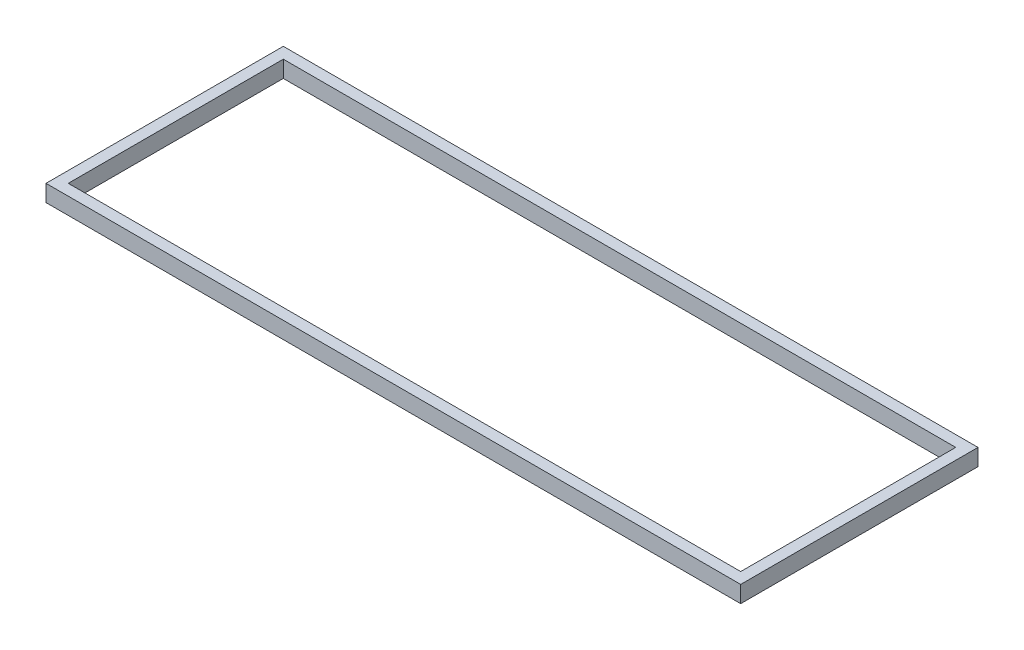
ISO-10303-21;
HEADER;
FILE_DESCRIPTION(('STEP AP214'),'2;1');
FILE_NAME('part.step','',(''),(''),'','','');
FILE_SCHEMA(('AUTOMOTIVE_DESIGN { 1 0 10303 214 1 1 1 1 }'));
ENDSEC;
DATA;
#1=APPLICATION_CONTEXT('core data for automotive mechanical design processes');
#2=APPLICATION_PROTOCOL_DEFINITION('international standard','automotive_design',2000,#1);
#3=PRODUCT_CONTEXT('',#1,'mechanical');
#4=PRODUCT('Part','Part','',(#3));
#5=PRODUCT_RELATED_PRODUCT_CATEGORY('part','',(#4));
#6=PRODUCT_DEFINITION_FORMATION('','',#4);
#7=PRODUCT_DEFINITION_CONTEXT('part definition',#1,'design');
#8=PRODUCT_DEFINITION('design','',#6,#7);
#9=PRODUCT_DEFINITION_SHAPE('','',#8);
#10=(LENGTH_UNIT() NAMED_UNIT(*) SI_UNIT(.MILLI.,.METRE.));
#11=(NAMED_UNIT(*) PLANE_ANGLE_UNIT() SI_UNIT($,.RADIAN.));
#12=(NAMED_UNIT(*) SI_UNIT($,.STERADIAN.) SOLID_ANGLE_UNIT());
#13=UNCERTAINTY_MEASURE_WITH_UNIT(LENGTH_MEASURE(1.E-05),#10,'distance_accuracy_value','');
#14=(GEOMETRIC_REPRESENTATION_CONTEXT(3) GLOBAL_UNCERTAINTY_ASSIGNED_CONTEXT((#13)) GLOBAL_UNIT_ASSIGNED_CONTEXT((#10,
#11,#12)) REPRESENTATION_CONTEXT('',''));
#15=CARTESIAN_POINT('',(0.,0.,0.));
#16=DIRECTION('',(0.,0.,1.));
#17=DIRECTION('',(1.,0.,0.));
#18=AXIS2_PLACEMENT_3D('',#15,#16,#17);
#19=CARTESIAN_POINT('',(0.,6.,0.));
#20=DIRECTION('',(0.,-1.,0.));
#21=DIRECTION('',(0.,0.,-1.));
#22=AXIS2_PLACEMENT_3D('',#19,#20,#21);
#23=PLANE('',#22);
#24=DIRECTION('',(0.,0.,1.));
#25=VECTOR('',#24,1.);
#26=CARTESIAN_POINT('',(0.,6.,0.));
#27=LINE('',#26,#25);
#28=CARTESIAN_POINT('',(0.,6.,-85.25));
#29=VERTEX_POINT('',#28);
#30=CARTESIAN_POINT('',(0.,6.,0.));
#31=VERTEX_POINT('',#30);
#32=EDGE_CURVE('E153',#29,#31,#27,.T.);
#33=ORIENTED_EDGE('',*,*,#32,.T.);
#34=DIRECTION('',(1.,0.,0.));
#35=VECTOR('',#34,1.);
#36=CARTESIAN_POINT('',(0.,6.,0.));
#37=LINE('',#36,#35);
#38=CARTESIAN_POINT('',(249.56,6.,0.));
#39=VERTEX_POINT('',#38);
#40=EDGE_CURVE('E157',#31,#39,#37,.T.);
#41=ORIENTED_EDGE('',*,*,#40,.T.);
#42=DIRECTION('',(0.,0.,-1.));
#43=VECTOR('',#42,1.);
#44=CARTESIAN_POINT('',(249.56,6.,0.));
#45=LINE('',#44,#43);
#46=CARTESIAN_POINT('',(249.56,6.,-85.25));
#47=VERTEX_POINT('',#46);
#48=EDGE_CURVE('E161',#39,#47,#45,.T.);
#49=ORIENTED_EDGE('',*,*,#48,.T.);
#50=DIRECTION('',(-1.,0.,0.));
#51=VECTOR('',#50,1.);
#52=CARTESIAN_POINT('',(0.,6.,-85.25));
#53=LINE('',#52,#51);
#54=EDGE_CURVE('E164',#47,#29,#53,.T.);
#55=ORIENTED_EDGE('',*,*,#54,.T.);
#56=EDGE_LOOP('',(#33,#41,#49,#55));
#57=FACE_BOUND('',#56,.T.);
#58=DIRECTION('',(0.,0.,1.));
#59=VECTOR('',#58,1.);
#60=CARTESIAN_POINT('',(4.,6.,-81.25));
#61=LINE('',#60,#59);
#62=CARTESIAN_POINT('',(4.,6.,-81.25));
#63=VERTEX_POINT('',#62);
#64=CARTESIAN_POINT('',(4.00000000000001,6.,-4.));
#65=VERTEX_POINT('',#64);
#66=EDGE_CURVE('E105',#63,#65,#61,.T.);
#67=ORIENTED_EDGE('',*,*,#66,.F.);
#68=DIRECTION('',(-1.,0.,0.));
#69=VECTOR('',#68,1.);
#70=CARTESIAN_POINT('',(4.,6.,-81.25));
#71=LINE('',#70,#69);
#72=CARTESIAN_POINT('',(245.56,6.,-81.25));
#73=VERTEX_POINT('',#72);
#74=EDGE_CURVE('E131',#73,#63,#71,.T.);
#75=ORIENTED_EDGE('',*,*,#74,.F.);
#76=DIRECTION('',(0.,0.,-1.));
#77=VECTOR('',#76,1.);
#78=CARTESIAN_POINT('',(245.56,6.,-81.25));
#79=LINE('',#78,#77);
#80=CARTESIAN_POINT('',(245.56,6.,-4.));
#81=VERTEX_POINT('',#80);
#82=EDGE_CURVE('E127',#81,#73,#79,.T.);
#83=ORIENTED_EDGE('',*,*,#82,.F.);
#84=DIRECTION('',(1.,0.,0.));
#85=VECTOR('',#84,1.);
#86=CARTESIAN_POINT('',(4.00000000000001,6.,-4.));
#87=LINE('',#86,#85);
#88=EDGE_CURVE('E114',#65,#81,#87,.T.);
#89=ORIENTED_EDGE('',*,*,#88,.F.);
#90=EDGE_LOOP('',(#67,#75,#83,#89));
#91=FACE_BOUND('',#90,.T.);
#92=ADVANCED_FACE('F39',(#57,#91),#23,.F.);
#93=CARTESIAN_POINT('',(0.,0.,0.));
#94=DIRECTION('',(0.,-1.,0.));
#95=DIRECTION('',(0.,0.,-1.));
#96=AXIS2_PLACEMENT_3D('',#93,#94,#95);
#97=PLANE('',#96);
#98=DIRECTION('',(0.,0.,1.));
#99=VECTOR('',#98,1.);
#100=CARTESIAN_POINT('',(0.,0.,0.));
#101=LINE('',#100,#99);
#102=CARTESIAN_POINT('',(0.,0.,-85.25));
#103=VERTEX_POINT('',#102);
#104=CARTESIAN_POINT('',(0.,0.,0.));
#105=VERTEX_POINT('',#104);
#106=EDGE_CURVE('E123',#103,#105,#101,.T.);
#107=ORIENTED_EDGE('',*,*,#106,.F.);
#108=DIRECTION('',(-1.,0.,0.));
#109=VECTOR('',#108,1.);
#110=CARTESIAN_POINT('',(0.,0.,-85.25));
#111=LINE('',#110,#109);
#112=CARTESIAN_POINT('',(249.56,0.,-85.25));
#113=VERTEX_POINT('',#112);
#114=EDGE_CURVE('E158',#113,#103,#111,.T.);
#115=ORIENTED_EDGE('',*,*,#114,.F.);
#116=DIRECTION('',(0.,0.,-1.));
#117=VECTOR('',#116,1.);
#118=CARTESIAN_POINT('',(249.56,0.,0.));
#119=LINE('',#118,#117);
#120=CARTESIAN_POINT('',(249.56,0.,0.));
#121=VERTEX_POINT('',#120);
#122=EDGE_CURVE('E174',#121,#113,#119,.T.);
#123=ORIENTED_EDGE('',*,*,#122,.F.);
#124=DIRECTION('',(1.,0.,0.));
#125=VECTOR('',#124,1.);
#126=CARTESIAN_POINT('',(0.,0.,0.));
#127=LINE('',#126,#125);
#128=EDGE_CURVE('E171',#105,#121,#127,.T.);
#129=ORIENTED_EDGE('',*,*,#128,.F.);
#130=EDGE_LOOP('',(#107,#115,#123,#129));
#131=FACE_BOUND('',#130,.T.);
#132=DIRECTION('',(-1.,0.,0.));
#133=VECTOR('',#132,1.);
#134=CARTESIAN_POINT('',(4.,0.,-81.25));
#135=LINE('',#134,#133);
#136=CARTESIAN_POINT('',(245.56,0.,-81.25));
#137=VERTEX_POINT('',#136);
#138=CARTESIAN_POINT('',(4.,0.,-81.25));
#139=VERTEX_POINT('',#138);
#140=EDGE_CURVE('E115',#137,#139,#135,.T.);
#141=ORIENTED_EDGE('',*,*,#140,.T.);
#142=DIRECTION('',(0.,0.,1.));
#143=VECTOR('',#142,1.);
#144=CARTESIAN_POINT('',(4.,0.,-81.25));
#145=LINE('',#144,#143);
#146=CARTESIAN_POINT('',(4.00000000000001,0.,-4.));
#147=VERTEX_POINT('',#146);
#148=EDGE_CURVE('E63',#139,#147,#145,.T.);
#149=ORIENTED_EDGE('',*,*,#148,.T.);
#150=DIRECTION('',(1.,0.,0.));
#151=VECTOR('',#150,1.);
#152=CARTESIAN_POINT('',(4.00000000000001,0.,-4.));
#153=LINE('',#152,#151);
#154=CARTESIAN_POINT('',(245.56,0.,-4.));
#155=VERTEX_POINT('',#154);
#156=EDGE_CURVE('E121',#147,#155,#153,.T.);
#157=ORIENTED_EDGE('',*,*,#156,.T.);
#158=DIRECTION('',(0.,0.,-1.));
#159=VECTOR('',#158,1.);
#160=CARTESIAN_POINT('',(245.56,0.,-81.25));
#161=LINE('',#160,#159);
#162=EDGE_CURVE('E140',#155,#137,#161,.T.);
#163=ORIENTED_EDGE('',*,*,#162,.T.);
#164=EDGE_LOOP('',(#141,#149,#157,#163));
#165=FACE_BOUND('',#164,.T.);
#166=ADVANCED_FACE('F197',(#131,#165),#97,.T.);
#167=CARTESIAN_POINT('',(0.,6.,0.));
#168=DIRECTION('',(1.,0.,0.));
#169=DIRECTION('',(0.,0.,-1.));
#170=AXIS2_PLACEMENT_3D('',#167,#168,#169);
#171=PLANE('',#170);
#172=ORIENTED_EDGE('',*,*,#106,.T.);
#173=DIRECTION('',(0.,-1.,0.));
#174=VECTOR('',#173,1.);
#175=CARTESIAN_POINT('',(0.,6.,0.));
#176=LINE('',#175,#174);
#177=EDGE_CURVE('E11',#31,#105,#176,.T.);
#178=ORIENTED_EDGE('',*,*,#177,.F.);
#179=ORIENTED_EDGE('',*,*,#32,.F.);
#180=DIRECTION('',(0.,-1.,0.));
#181=VECTOR('',#180,1.);
#182=CARTESIAN_POINT('',(0.,6.,-85.25));
#183=LINE('',#182,#181);
#184=EDGE_CURVE('E167',#29,#103,#183,.T.);
#185=ORIENTED_EDGE('',*,*,#184,.T.);
#186=EDGE_LOOP('',(#172,#178,#179,#185));
#187=FACE_BOUND('',#186,.T.);
#188=ADVANCED_FACE('F41',(#187),#171,.F.);
#189=CARTESIAN_POINT('',(0.,6.,0.));
#190=DIRECTION('',(0.,0.,-1.));
#191=DIRECTION('',(-1.,0.,0.));
#192=AXIS2_PLACEMENT_3D('',#189,#190,#191);
#193=PLANE('',#192);
#194=ORIENTED_EDGE('',*,*,#128,.T.);
#195=DIRECTION('',(0.,-1.,0.));
#196=VECTOR('',#195,1.);
#197=CARTESIAN_POINT('',(249.56,6.,0.));
#198=LINE('',#197,#196);
#199=EDGE_CURVE('E48',#39,#121,#198,.T.);
#200=ORIENTED_EDGE('',*,*,#199,.F.);
#201=ORIENTED_EDGE('',*,*,#40,.F.);
#202=ORIENTED_EDGE('',*,*,#177,.T.);
#203=EDGE_LOOP('',(#194,#200,#201,#202));
#204=FACE_BOUND('',#203,.T.);
#205=ADVANCED_FACE('F207',(#204),#193,.F.);
#206=CARTESIAN_POINT('',(249.56,6.,0.));
#207=DIRECTION('',(-1.,0.,0.));
#208=DIRECTION('',(0.,0.,1.));
#209=AXIS2_PLACEMENT_3D('',#206,#207,#208);
#210=PLANE('',#209);
#211=ORIENTED_EDGE('',*,*,#122,.T.);
#212=DIRECTION('',(0.,-1.,0.));
#213=VECTOR('',#212,1.);
#214=CARTESIAN_POINT('',(249.56,6.,-85.25));
#215=LINE('',#214,#213);
#216=EDGE_CURVE('E182',#47,#113,#215,.T.);
#217=ORIENTED_EDGE('',*,*,#216,.F.);
#218=ORIENTED_EDGE('',*,*,#48,.F.);
#219=ORIENTED_EDGE('',*,*,#199,.T.);
#220=EDGE_LOOP('',(#211,#217,#218,#219));
#221=FACE_BOUND('',#220,.T.);
#222=ADVANCED_FACE('F191',(#221),#210,.F.);
#223=CARTESIAN_POINT('',(0.,6.,-85.25));
#224=DIRECTION('',(0.,0.,1.));
#225=DIRECTION('',(1.,0.,0.));
#226=AXIS2_PLACEMENT_3D('',#223,#224,#225);
#227=PLANE('',#226);
#228=ORIENTED_EDGE('',*,*,#114,.T.);
#229=ORIENTED_EDGE('',*,*,#184,.F.);
#230=ORIENTED_EDGE('',*,*,#54,.F.);
#231=ORIENTED_EDGE('',*,*,#216,.T.);
#232=EDGE_LOOP('',(#228,#229,#230,#231));
#233=FACE_BOUND('',#232,.T.);
#234=ADVANCED_FACE('F201',(#233),#227,.F.);
#235=CARTESIAN_POINT('',(4.,6.,-81.25));
#236=DIRECTION('',(1.,0.,0.));
#237=DIRECTION('',(0.,0.,-1.));
#238=AXIS2_PLACEMENT_3D('',#235,#236,#237);
#239=PLANE('',#238);
#240=ORIENTED_EDGE('',*,*,#148,.F.);
#241=DIRECTION('',(0.,-1.,0.));
#242=VECTOR('',#241,1.);
#243=CARTESIAN_POINT('',(4.,6.,-81.25));
#244=LINE('',#243,#242);
#245=EDGE_CURVE('E109',#63,#139,#244,.T.);
#246=ORIENTED_EDGE('',*,*,#245,.F.);
#247=ORIENTED_EDGE('',*,*,#66,.T.);
#248=DIRECTION('',(0.,-1.,0.));
#249=VECTOR('',#248,1.);
#250=CARTESIAN_POINT('',(4.00000000000001,6.,-4.));
#251=LINE('',#250,#249);
#252=EDGE_CURVE('E108',#65,#147,#251,.T.);
#253=ORIENTED_EDGE('',*,*,#252,.T.);
#254=EDGE_LOOP('',(#240,#246,#247,#253));
#255=FACE_BOUND('',#254,.T.);
#256=ADVANCED_FACE('F107',(#255),#239,.T.);
#257=CARTESIAN_POINT('',(4.00000000000001,6.,-4.));
#258=DIRECTION('',(0.,0.,-1.));
#259=DIRECTION('',(-1.,0.,0.));
#260=AXIS2_PLACEMENT_3D('',#257,#258,#259);
#261=PLANE('',#260);
#262=ORIENTED_EDGE('',*,*,#156,.F.);
#263=ORIENTED_EDGE('',*,*,#252,.F.);
#264=ORIENTED_EDGE('',*,*,#88,.T.);
#265=DIRECTION('',(0.,-1.,0.));
#266=VECTOR('',#265,1.);
#267=CARTESIAN_POINT('',(245.56,6.,-4.));
#268=LINE('',#267,#266);
#269=EDGE_CURVE('E124',#81,#155,#268,.T.);
#270=ORIENTED_EDGE('',*,*,#269,.T.);
#271=EDGE_LOOP('',(#262,#263,#264,#270));
#272=FACE_BOUND('',#271,.T.);
#273=ADVANCED_FACE('F118',(#272),#261,.T.);
#274=CARTESIAN_POINT('',(245.56,6.,-81.25));
#275=DIRECTION('',(-1.,0.,0.));
#276=DIRECTION('',(0.,0.,1.));
#277=AXIS2_PLACEMENT_3D('',#274,#275,#276);
#278=PLANE('',#277);
#279=ORIENTED_EDGE('',*,*,#162,.F.);
#280=ORIENTED_EDGE('',*,*,#269,.F.);
#281=ORIENTED_EDGE('',*,*,#82,.T.);
#282=DIRECTION('',(0.,-1.,0.));
#283=VECTOR('',#282,1.);
#284=CARTESIAN_POINT('',(245.56,6.,-81.25));
#285=LINE('',#284,#283);
#286=EDGE_CURVE('E55',#73,#137,#285,.T.);
#287=ORIENTED_EDGE('',*,*,#286,.T.);
#288=EDGE_LOOP('',(#279,#280,#281,#287));
#289=FACE_BOUND('',#288,.T.);
#290=ADVANCED_FACE('F230',(#289),#278,.T.);
#291=CARTESIAN_POINT('',(4.,6.,-81.25));
#292=DIRECTION('',(0.,0.,1.));
#293=DIRECTION('',(1.,0.,0.));
#294=AXIS2_PLACEMENT_3D('',#291,#292,#293);
#295=PLANE('',#294);
#296=ORIENTED_EDGE('',*,*,#140,.F.);
#297=ORIENTED_EDGE('',*,*,#286,.F.);
#298=ORIENTED_EDGE('',*,*,#74,.T.);
#299=ORIENTED_EDGE('',*,*,#245,.T.);
#300=EDGE_LOOP('',(#296,#297,#298,#299));
#301=FACE_BOUND('',#300,.T.);
#302=ADVANCED_FACE('F234',(#301),#295,.T.);
#303=CLOSED_SHELL('',(#92,#166,#188,#205,#222,#234,#256,#273,#290,#302));
#304=MANIFOLD_SOLID_BREP('B2',#303);
#305=ADVANCED_BREP_SHAPE_REPRESENTATION('',(#18,#304),#14);
#306=SHAPE_DEFINITION_REPRESENTATION(#9,#305);
ENDSEC;
END-ISO-10303-21;
